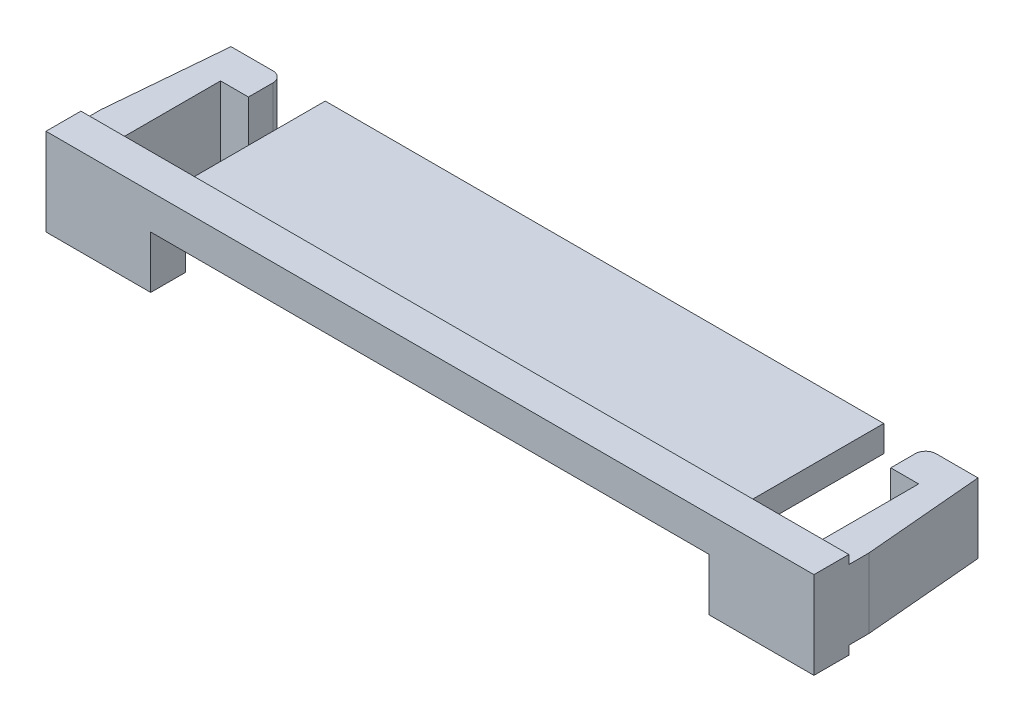
ISO-10303-21;
HEADER;
FILE_DESCRIPTION(('STEP AP214'),'2;1');
FILE_NAME('part.step','',(''),(''),'','','');
FILE_SCHEMA(('AUTOMOTIVE_DESIGN { 1 0 10303 214 1 1 1 1 }'));
ENDSEC;
DATA;
#1=APPLICATION_CONTEXT('core data for automotive mechanical design processes');
#2=APPLICATION_PROTOCOL_DEFINITION('international standard','automotive_design',2000,#1);
#3=PRODUCT_CONTEXT('',#1,'mechanical');
#4=PRODUCT('Part','Part','',(#3));
#5=PRODUCT_RELATED_PRODUCT_CATEGORY('part','',(#4));
#6=PRODUCT_DEFINITION_FORMATION('','',#4);
#7=PRODUCT_DEFINITION_CONTEXT('part definition',#1,'design');
#8=PRODUCT_DEFINITION('design','',#6,#7);
#9=PRODUCT_DEFINITION_SHAPE('','',#8);
#10=(LENGTH_UNIT() NAMED_UNIT(*) SI_UNIT(.MILLI.,.METRE.));
#11=(NAMED_UNIT(*) PLANE_ANGLE_UNIT() SI_UNIT($,.RADIAN.));
#12=(NAMED_UNIT(*) SI_UNIT($,.STERADIAN.) SOLID_ANGLE_UNIT());
#13=UNCERTAINTY_MEASURE_WITH_UNIT(LENGTH_MEASURE(1.E-05),#10,'distance_accuracy_value','');
#14=(GEOMETRIC_REPRESENTATION_CONTEXT(3) GLOBAL_UNCERTAINTY_ASSIGNED_CONTEXT((#13)) GLOBAL_UNIT_ASSIGNED_CONTEXT((#10,
#11,#12)) REPRESENTATION_CONTEXT('',''));
#15=CARTESIAN_POINT('',(0.,0.,0.));
#16=DIRECTION('',(0.,0.,1.));
#17=DIRECTION('',(1.,0.,0.));
#18=AXIS2_PLACEMENT_3D('',#15,#16,#17);
#19=CARTESIAN_POINT('',(-11.,-1.25,5.));
#20=DIRECTION('',(0.,1.,0.));
#21=DIRECTION('',(0.,0.,1.));
#22=AXIS2_PLACEMENT_3D('',#19,#20,#21);
#23=PLANE('',#22);
#24=DIRECTION('',(1.,0.,0.));
#25=VECTOR('',#24,1.);
#26=CARTESIAN_POINT('',(-11.,-1.25,5.));
#27=LINE('',#26,#25);
#28=CARTESIAN_POINT('',(8.,-1.25,5.));
#29=VERTEX_POINT('',#28);
#30=CARTESIAN_POINT('',(11.,-1.25,5.));
#31=VERTEX_POINT('',#30);
#32=EDGE_CURVE('E361',#29,#31,#27,.T.);
#33=ORIENTED_EDGE('',*,*,#32,.F.);
#34=DIRECTION('',(0.,0.,-1.));
#35=VECTOR('',#34,1.);
#36=CARTESIAN_POINT('',(8.,-1.25,5.));
#37=LINE('',#36,#35);
#38=CARTESIAN_POINT('',(8.,-1.25,4.));
#39=VERTEX_POINT('',#38);
#40=EDGE_CURVE('E265',#29,#39,#37,.T.);
#41=ORIENTED_EDGE('',*,*,#40,.T.);
#42=DIRECTION('',(-1.,0.,0.));
#43=VECTOR('',#42,1.);
#44=CARTESIAN_POINT('',(-11.,-1.25,4.));
#45=LINE('',#44,#43);
#46=CARTESIAN_POINT('',(11.,-1.25,4.));
#47=VERTEX_POINT('',#46);
#48=EDGE_CURVE('E346',#47,#39,#45,.T.);
#49=ORIENTED_EDGE('',*,*,#48,.F.);
#50=DIRECTION('',(0.,0.,-1.));
#51=VECTOR('',#50,1.);
#52=CARTESIAN_POINT('',(11.,-1.25,5.));
#53=LINE('',#52,#51);
#54=EDGE_CURVE('E365',#31,#47,#53,.T.);
#55=ORIENTED_EDGE('',*,*,#54,.F.);
#56=EDGE_LOOP('',(#33,#41,#49,#55));
#57=FACE_BOUND('',#56,.T.);
#58=ADVANCED_FACE('F34',(#57),#23,.F.);
#59=CARTESIAN_POINT('',(0.,0.,0.));
#60=DIRECTION('',(0.,0.,1.));
#61=DIRECTION('',(1.,0.,0.));
#62=AXIS2_PLACEMENT_3D('',#59,#60,#61);
#63=PLANE('',#62);
#64=DIRECTION('',(-1.,0.,0.));
#65=VECTOR('',#64,1.);
#66=CARTESIAN_POINT('',(11.,1.,0.));
#67=LINE('',#66,#65);
#68=CARTESIAN_POINT('',(10.7,1.,0.));
#69=VERTEX_POINT('',#68);
#70=CARTESIAN_POINT('',(9.5,1.,0.));
#71=VERTEX_POINT('',#70);
#72=EDGE_CURVE('E316',#69,#71,#67,.T.);
#73=ORIENTED_EDGE('',*,*,#72,.F.);
#74=DIRECTION('',(0.,-1.,0.));
#75=VECTOR('',#74,1.);
#76=CARTESIAN_POINT('',(10.7,0.,0.));
#77=LINE('',#76,#75);
#78=CARTESIAN_POINT('',(10.7,-1.,0.));
#79=VERTEX_POINT('',#78);
#80=EDGE_CURVE('E408',#69,#79,#77,.T.);
#81=ORIENTED_EDGE('',*,*,#80,.T.);
#82=DIRECTION('',(1.,0.,0.));
#83=VECTOR('',#82,1.);
#84=CARTESIAN_POINT('',(-11.,-1.,0.));
#85=LINE('',#84,#83);
#86=CARTESIAN_POINT('',(9.5,-1.,0.));
#87=VERTEX_POINT('',#86);
#88=EDGE_CURVE('E292',#87,#79,#85,.T.);
#89=ORIENTED_EDGE('',*,*,#88,.F.);
#90=DIRECTION('',(0.,1.,0.));
#91=VECTOR('',#90,1.);
#92=CARTESIAN_POINT('',(9.5,1.,0.));
#93=LINE('',#92,#91);
#94=EDGE_CURVE('E385',#87,#71,#93,.T.);
#95=ORIENTED_EDGE('',*,*,#94,.T.);
#96=EDGE_LOOP('',(#73,#81,#89,#95));
#97=FACE_BOUND('',#96,.T.);
#98=ADVANCED_FACE('F489',(#97),#63,.F.);
#99=CARTESIAN_POINT('',(-10.7,-1.,0.));
#100=VERTEX_POINT('',#99);
#101=CARTESIAN_POINT('',(-9.5,-1.,0.));
#102=VERTEX_POINT('',#101);
#103=EDGE_CURVE('E339',#100,#102,#85,.T.);
#104=ORIENTED_EDGE('',*,*,#103,.F.);
#105=DIRECTION('',(0.,1.,0.));
#106=VECTOR('',#105,1.);
#107=CARTESIAN_POINT('',(-10.7,0.,0.));
#108=LINE('',#107,#106);
#109=CARTESIAN_POINT('',(-10.7,1.,0.));
#110=VERTEX_POINT('',#109);
#111=EDGE_CURVE('E42',#100,#110,#108,.T.);
#112=ORIENTED_EDGE('',*,*,#111,.T.);
#113=CARTESIAN_POINT('',(-9.5,1.,0.));
#114=VERTEX_POINT('',#113);
#115=EDGE_CURVE('E328',#114,#110,#67,.T.);
#116=ORIENTED_EDGE('',*,*,#115,.F.);
#117=DIRECTION('',(0.,1.,0.));
#118=VECTOR('',#117,1.);
#119=CARTESIAN_POINT('',(-9.5,-1.,0.));
#120=LINE('',#119,#118);
#121=EDGE_CURVE('E398',#114,#102,#120,.F.);
#122=ORIENTED_EDGE('',*,*,#121,.T.);
#123=EDGE_LOOP('',(#104,#112,#116,#122));
#124=FACE_BOUND('',#123,.T.);
#125=ADVANCED_FACE('F494',(#124),#63,.F.);
#126=CARTESIAN_POINT('',(-11.,-1.,4.));
#127=DIRECTION('',(0.,1.,0.));
#128=DIRECTION('',(-1.,0.,0.));
#129=AXIS2_PLACEMENT_3D('',#126,#127,#128);
#130=PLANE('',#129);
#131=ORIENTED_EDGE('',*,*,#88,.T.);
#132=DIRECTION('',(-0.0871557427476589,0.,-0.996194698091746));
#133=VECTOR('',#132,1.);
#134=CARTESIAN_POINT('',(11.,-1.,3.42901569082837));
#135=LINE('',#134,#133);
#136=CARTESIAN_POINT('',(11.,-1.,3.42901569082837));
#137=VERTEX_POINT('',#136);
#138=EDGE_CURVE('E410',#79,#137,#135,.F.);
#139=ORIENTED_EDGE('',*,*,#138,.T.);
#140=DIRECTION('',(0.,0.,-1.));
#141=VECTOR('',#140,1.);
#142=CARTESIAN_POINT('',(11.,-1.,4.));
#143=LINE('',#142,#141);
#144=CARTESIAN_POINT('',(11.,-1.,4.));
#145=VERTEX_POINT('',#144);
#146=EDGE_CURVE('E351',#145,#137,#143,.T.);
#147=ORIENTED_EDGE('',*,*,#146,.F.);
#148=DIRECTION('',(1.,0.,0.));
#149=VECTOR('',#148,1.);
#150=CARTESIAN_POINT('',(-11.,-1.,4.));
#151=LINE('',#150,#149);
#152=CARTESIAN_POINT('',(10.,-1.,4.));
#153=VERTEX_POINT('',#152);
#154=EDGE_CURVE('E338',#153,#145,#151,.T.);
#155=ORIENTED_EDGE('',*,*,#154,.F.);
#156=DIRECTION('',(0.,0.,-1.));
#157=VECTOR('',#156,1.);
#158=CARTESIAN_POINT('',(10.,-1.,4.));
#159=LINE('',#158,#157);
#160=CARTESIAN_POINT('',(10.,-1.,1.));
#161=VERTEX_POINT('',#160);
#162=EDGE_CURVE('E237',#153,#161,#159,.T.);
#163=ORIENTED_EDGE('',*,*,#162,.T.);
#164=DIRECTION('',(1.,0.,0.));
#165=VECTOR('',#164,1.);
#166=CARTESIAN_POINT('',(11.,-1.,1.));
#167=LINE('',#166,#165);
#168=CARTESIAN_POINT('',(9.2,-1.,1.));
#169=VERTEX_POINT('',#168);
#170=EDGE_CURVE('E223',#169,#161,#167,.T.);
#171=ORIENTED_EDGE('',*,*,#170,.F.);
#172=DIRECTION('',(0.,0.,1.));
#173=VECTOR('',#172,1.);
#174=CARTESIAN_POINT('',(9.2,-1.,0.));
#175=LINE('',#174,#173);
#176=CARTESIAN_POINT('',(9.2,-1.,0.3));
#177=VERTEX_POINT('',#176);
#178=EDGE_CURVE('E212',#177,#169,#175,.T.);
#179=ORIENTED_EDGE('',*,*,#178,.F.);
#180=CARTESIAN_POINT('',(9.5,-1.,0.3));
#181=DIRECTION('',(0.,1.,0.));
#182=DIRECTION('',(-1.,0.,0.));
#183=AXIS2_PLACEMENT_3D('',#180,#181,#182);
#184=CIRCLE('',#183,0.3);
#185=EDGE_CURVE('E391',#177,#87,#184,.F.);
#186=ORIENTED_EDGE('',*,*,#185,.T.);
#187=EDGE_LOOP('',(#131,#139,#147,#155,#163,#171,#179,#186));
#188=FACE_BOUND('',#187,.T.);
#189=ADVANCED_FACE('F235',(#188),#130,.F.);
#190=DIRECTION('',(0.,0.,-1.));
#191=VECTOR('',#190,1.);
#192=CARTESIAN_POINT('',(-11.,-1.,4.));
#193=LINE('',#192,#191);
#194=CARTESIAN_POINT('',(-11.,-1.,4.));
#195=VERTEX_POINT('',#194);
#196=CARTESIAN_POINT('',(-11.,-1.,3.42901569082837));
#197=VERTEX_POINT('',#196);
#198=EDGE_CURVE('E349',#195,#197,#193,.T.);
#199=ORIENTED_EDGE('',*,*,#198,.T.);
#200=DIRECTION('',(-0.0871557427476589,0.,0.996194698091746));
#201=VECTOR('',#200,1.);
#202=CARTESIAN_POINT('',(-11.,-1.,3.42901569082837));
#203=LINE('',#202,#201);
#204=EDGE_CURVE('E56',#197,#100,#203,.F.);
#205=ORIENTED_EDGE('',*,*,#204,.T.);
#206=ORIENTED_EDGE('',*,*,#103,.T.);
#207=CARTESIAN_POINT('',(-9.5,-1.,0.3));
#208=DIRECTION('',(0.,1.,0.));
#209=DIRECTION('',(-1.,0.,0.));
#210=AXIS2_PLACEMENT_3D('',#207,#208,#209);
#211=CIRCLE('',#210,0.3);
#212=CARTESIAN_POINT('',(-9.2,-1.,0.3));
#213=VERTEX_POINT('',#212);
#214=EDGE_CURVE('E401',#102,#213,#211,.F.);
#215=ORIENTED_EDGE('',*,*,#214,.T.);
#216=DIRECTION('',(0.,0.,-1.));
#217=VECTOR('',#216,1.);
#218=CARTESIAN_POINT('',(-9.2,-1.,0.));
#219=LINE('',#218,#217);
#220=CARTESIAN_POINT('',(-9.2,-1.,1.));
#221=VERTEX_POINT('',#220);
#222=EDGE_CURVE('E245',#221,#213,#219,.T.);
#223=ORIENTED_EDGE('',*,*,#222,.F.);
#224=DIRECTION('',(1.,0.,0.));
#225=VECTOR('',#224,1.);
#226=CARTESIAN_POINT('',(-11.,-1.,1.));
#227=LINE('',#226,#225);
#228=CARTESIAN_POINT('',(-9.99999999999999,-1.,1.));
#229=VERTEX_POINT('',#228);
#230=EDGE_CURVE('E243',#229,#221,#227,.T.);
#231=ORIENTED_EDGE('',*,*,#230,.F.);
#232=DIRECTION('',(0.,0.,-1.));
#233=VECTOR('',#232,1.);
#234=CARTESIAN_POINT('',(-9.99999999999999,-1.,4.));
#235=LINE('',#234,#233);
#236=CARTESIAN_POINT('',(-9.99999999999999,-1.,4.));
#237=VERTEX_POINT('',#236);
#238=EDGE_CURVE('E289',#237,#229,#235,.T.);
#239=ORIENTED_EDGE('',*,*,#238,.F.);
#240=EDGE_CURVE('E340',#195,#237,#151,.T.);
#241=ORIENTED_EDGE('',*,*,#240,.F.);
#242=EDGE_LOOP('',(#199,#205,#206,#215,#223,#231,#239,#241));
#243=FACE_BOUND('',#242,.T.);
#244=ADVANCED_FACE('F424',(#243),#130,.F.);
#245=CARTESIAN_POINT('',(11.,1.,4.));
#246=DIRECTION('',(0.,-1.,0.));
#247=DIRECTION('',(0.,0.,-1.));
#248=AXIS2_PLACEMENT_3D('',#245,#246,#247);
#249=PLANE('',#248);
#250=DIRECTION('',(0.,0.,-1.));
#251=VECTOR('',#250,1.);
#252=CARTESIAN_POINT('',(11.,1.,4.));
#253=LINE('',#252,#251);
#254=CARTESIAN_POINT('',(11.,1.,4.));
#255=VERTEX_POINT('',#254);
#256=CARTESIAN_POINT('',(11.,1.,3.42901569082837));
#257=VERTEX_POINT('',#256);
#258=EDGE_CURVE('E325',#255,#257,#253,.T.);
#259=ORIENTED_EDGE('',*,*,#258,.T.);
#260=DIRECTION('',(0.0871557427476589,0.,0.996194698091746));
#261=VECTOR('',#260,1.);
#262=CARTESIAN_POINT('',(11.,1.,3.42901569082837));
#263=LINE('',#262,#261);
#264=EDGE_CURVE('E406',#257,#69,#263,.F.);
#265=ORIENTED_EDGE('',*,*,#264,.T.);
#266=ORIENTED_EDGE('',*,*,#72,.T.);
#267=CARTESIAN_POINT('',(9.5,1.,0.3));
#268=DIRECTION('',(0.,-1.,0.));
#269=DIRECTION('',(0.,0.,-1.));
#270=AXIS2_PLACEMENT_3D('',#267,#268,#269);
#271=CIRCLE('',#270,0.3);
#272=CARTESIAN_POINT('',(9.2,1.,0.3));
#273=VERTEX_POINT('',#272);
#274=EDGE_CURVE('E388',#71,#273,#271,.F.);
#275=ORIENTED_EDGE('',*,*,#274,.T.);
#276=DIRECTION('',(0.,0.,1.));
#277=VECTOR('',#276,1.);
#278=CARTESIAN_POINT('',(9.2,1.,0.));
#279=LINE('',#278,#277);
#280=CARTESIAN_POINT('',(9.2,1.,1.));
#281=VERTEX_POINT('',#280);
#282=EDGE_CURVE('E240',#273,#281,#279,.T.);
#283=ORIENTED_EDGE('',*,*,#282,.T.);
#284=DIRECTION('',(1.,0.,0.));
#285=VECTOR('',#284,1.);
#286=CARTESIAN_POINT('',(11.,1.,1.));
#287=LINE('',#286,#285);
#288=CARTESIAN_POINT('',(10.,1.,1.));
#289=VERTEX_POINT('',#288);
#290=EDGE_CURVE('E224',#281,#289,#287,.T.);
#291=ORIENTED_EDGE('',*,*,#290,.T.);
#292=DIRECTION('',(0.,0.,-1.));
#293=VECTOR('',#292,1.);
#294=CARTESIAN_POINT('',(10.,1.,4.));
#295=LINE('',#294,#293);
#296=CARTESIAN_POINT('',(10.,1.,4.));
#297=VERTEX_POINT('',#296);
#298=EDGE_CURVE('E290',#297,#289,#295,.T.);
#299=ORIENTED_EDGE('',*,*,#298,.F.);
#300=DIRECTION('',(-1.,0.,0.));
#301=VECTOR('',#300,1.);
#302=CARTESIAN_POINT('',(11.,1.,4.));
#303=LINE('',#302,#301);
#304=EDGE_CURVE('E317',#255,#297,#303,.T.);
#305=ORIENTED_EDGE('',*,*,#304,.F.);
#306=EDGE_LOOP('',(#259,#265,#266,#275,#283,#291,#299,#305));
#307=FACE_BOUND('',#306,.T.);
#308=ADVANCED_FACE('F450',(#307),#249,.F.);
#309=ORIENTED_EDGE('',*,*,#115,.T.);
#310=DIRECTION('',(0.0871557427476589,0.,-0.996194698091746));
#311=VECTOR('',#310,1.);
#312=CARTESIAN_POINT('',(-11.,1.,3.42901569082837));
#313=LINE('',#312,#311);
#314=CARTESIAN_POINT('',(-11.,1.,3.42901569082837));
#315=VERTEX_POINT('',#314);
#316=EDGE_CURVE('E11',#110,#315,#313,.F.);
#317=ORIENTED_EDGE('',*,*,#316,.T.);
#318=DIRECTION('',(0.,0.,-1.));
#319=VECTOR('',#318,1.);
#320=CARTESIAN_POINT('',(-11.,1.,4.));
#321=LINE('',#320,#319);
#322=CARTESIAN_POINT('',(-11.,1.,4.));
#323=VERTEX_POINT('',#322);
#324=EDGE_CURVE('E329',#323,#315,#321,.T.);
#325=ORIENTED_EDGE('',*,*,#324,.F.);
#326=CARTESIAN_POINT('',(-9.99999999999999,1.,4.));
#327=VERTEX_POINT('',#326);
#328=EDGE_CURVE('E315',#327,#323,#303,.T.);
#329=ORIENTED_EDGE('',*,*,#328,.F.);
#330=DIRECTION('',(0.,0.,-1.));
#331=VECTOR('',#330,1.);
#332=CARTESIAN_POINT('',(-9.99999999999999,1.,4.));
#333=LINE('',#332,#331);
#334=CARTESIAN_POINT('',(-9.99999999999999,1.,1.));
#335=VERTEX_POINT('',#334);
#336=EDGE_CURVE('E303',#327,#335,#333,.T.);
#337=ORIENTED_EDGE('',*,*,#336,.T.);
#338=DIRECTION('',(1.,0.,0.));
#339=VECTOR('',#338,1.);
#340=CARTESIAN_POINT('',(-11.,1.,1.));
#341=LINE('',#340,#339);
#342=CARTESIAN_POINT('',(-9.2,1.,1.));
#343=VERTEX_POINT('',#342);
#344=EDGE_CURVE('E231',#335,#343,#341,.T.);
#345=ORIENTED_EDGE('',*,*,#344,.T.);
#346=DIRECTION('',(0.,0.,-1.));
#347=VECTOR('',#346,1.);
#348=CARTESIAN_POINT('',(-9.2,1.,0.));
#349=LINE('',#348,#347);
#350=CARTESIAN_POINT('',(-9.2,1.,0.3));
#351=VERTEX_POINT('',#350);
#352=EDGE_CURVE('E246',#343,#351,#349,.T.);
#353=ORIENTED_EDGE('',*,*,#352,.T.);
#354=CARTESIAN_POINT('',(-9.5,1.,0.3));
#355=DIRECTION('',(0.,-1.,0.));
#356=DIRECTION('',(0.,0.,-1.));
#357=AXIS2_PLACEMENT_3D('',#354,#355,#356);
#358=CIRCLE('',#357,0.3);
#359=EDGE_CURVE('E396',#351,#114,#358,.F.);
#360=ORIENTED_EDGE('',*,*,#359,.T.);
#361=EDGE_LOOP('',(#309,#317,#325,#329,#337,#345,#353,#360));
#362=FACE_BOUND('',#361,.T.);
#363=ADVANCED_FACE('F480',(#362),#249,.F.);
#364=CARTESIAN_POINT('',(-11.,1.25,5.));
#365=DIRECTION('',(0.,-1.,0.));
#366=DIRECTION('',(0.,0.,-1.));
#367=AXIS2_PLACEMENT_3D('',#364,#365,#366);
#368=PLANE('',#367);
#369=DIRECTION('',(1.,0.,0.));
#370=VECTOR('',#369,1.);
#371=CARTESIAN_POINT('',(11.,1.25,4.));
#372=LINE('',#371,#370);
#373=CARTESIAN_POINT('',(-11.,1.25,4.));
#374=VERTEX_POINT('',#373);
#375=CARTESIAN_POINT('',(11.,1.25,4.));
#376=VERTEX_POINT('',#375);
#377=EDGE_CURVE('E323',#374,#376,#372,.T.);
#378=ORIENTED_EDGE('',*,*,#377,.F.);
#379=DIRECTION('',(0.,0.,-1.));
#380=VECTOR('',#379,1.);
#381=CARTESIAN_POINT('',(-11.,1.25,5.));
#382=LINE('',#381,#380);
#383=CARTESIAN_POINT('',(-11.,1.25,5.));
#384=VERTEX_POINT('',#383);
#385=EDGE_CURVE('E371',#384,#374,#382,.T.);
#386=ORIENTED_EDGE('',*,*,#385,.F.);
#387=DIRECTION('',(-1.,0.,0.));
#388=VECTOR('',#387,1.);
#389=CARTESIAN_POINT('',(-11.,1.25,5.));
#390=LINE('',#389,#388);
#391=CARTESIAN_POINT('',(11.,1.25,5.));
#392=VERTEX_POINT('',#391);
#393=EDGE_CURVE('E357',#392,#384,#390,.T.);
#394=ORIENTED_EDGE('',*,*,#393,.F.);
#395=DIRECTION('',(0.,0.,-1.));
#396=VECTOR('',#395,1.);
#397=CARTESIAN_POINT('',(11.,1.25,5.));
#398=LINE('',#397,#396);
#399=EDGE_CURVE('E374',#392,#376,#398,.T.);
#400=ORIENTED_EDGE('',*,*,#399,.T.);
#401=EDGE_LOOP('',(#378,#386,#394,#400));
#402=FACE_BOUND('',#401,.T.);
#403=ADVANCED_FACE('F441',(#402),#368,.F.);
#404=CARTESIAN_POINT('',(-7.99999999999999,-1.25,4.));
#405=VERTEX_POINT('',#404);
#406=CARTESIAN_POINT('',(-11.,-1.25,4.));
#407=VERTEX_POINT('',#406);
#408=EDGE_CURVE('E345',#405,#407,#45,.T.);
#409=ORIENTED_EDGE('',*,*,#408,.F.);
#410=DIRECTION('',(0.,0.,-1.));
#411=VECTOR('',#410,1.);
#412=CARTESIAN_POINT('',(-7.99999999999999,-1.25,5.));
#413=LINE('',#412,#411);
#414=CARTESIAN_POINT('',(-7.99999999999999,-1.25,5.));
#415=VERTEX_POINT('',#414);
#416=EDGE_CURVE('E275',#415,#405,#413,.T.);
#417=ORIENTED_EDGE('',*,*,#416,.F.);
#418=CARTESIAN_POINT('',(-11.,-1.25,5.));
#419=VERTEX_POINT('',#418);
#420=EDGE_CURVE('E362',#419,#415,#27,.T.);
#421=ORIENTED_EDGE('',*,*,#420,.F.);
#422=DIRECTION('',(0.,0.,-1.));
#423=VECTOR('',#422,1.);
#424=CARTESIAN_POINT('',(-11.,-1.25,5.));
#425=LINE('',#424,#423);
#426=EDGE_CURVE('E368',#419,#407,#425,.T.);
#427=ORIENTED_EDGE('',*,*,#426,.T.);
#428=EDGE_LOOP('',(#409,#417,#421,#427));
#429=FACE_BOUND('',#428,.T.);
#430=ADVANCED_FACE('F434',(#429),#23,.F.);
#431=CARTESIAN_POINT('',(11.,1.25,5.));
#432=DIRECTION('',(-1.,0.,0.));
#433=DIRECTION('',(0.,0.,1.));
#434=AXIS2_PLACEMENT_3D('',#431,#432,#433);
#435=PLANE('',#434);
#436=ORIENTED_EDGE('',*,*,#146,.T.);
#437=DIRECTION('',(0.,1.,0.));
#438=VECTOR('',#437,1.);
#439=CARTESIAN_POINT('',(11.,1.25,3.42901569082837));
#440=LINE('',#439,#438);
#441=EDGE_CURVE('E403',#137,#257,#440,.T.);
#442=ORIENTED_EDGE('',*,*,#441,.T.);
#443=ORIENTED_EDGE('',*,*,#258,.F.);
#444=DIRECTION('',(0.,-1.,0.));
#445=VECTOR('',#444,1.);
#446=CARTESIAN_POINT('',(11.,1.25,4.));
#447=LINE('',#446,#445);
#448=EDGE_CURVE('E312',#376,#255,#447,.T.);
#449=ORIENTED_EDGE('',*,*,#448,.F.);
#450=ORIENTED_EDGE('',*,*,#399,.F.);
#451=DIRECTION('',(0.,1.,0.));
#452=VECTOR('',#451,1.);
#453=CARTESIAN_POINT('',(11.,1.25,5.));
#454=LINE('',#453,#452);
#455=EDGE_CURVE('E332',#31,#392,#454,.T.);
#456=ORIENTED_EDGE('',*,*,#455,.F.);
#457=ORIENTED_EDGE('',*,*,#54,.T.);
#458=DIRECTION('',(0.,-1.,0.));
#459=VECTOR('',#458,1.);
#460=CARTESIAN_POINT('',(11.,-1.25,4.));
#461=LINE('',#460,#459);
#462=EDGE_CURVE('E343',#145,#47,#461,.T.);
#463=ORIENTED_EDGE('',*,*,#462,.F.);
#464=EDGE_LOOP('',(#436,#442,#443,#449,#450,#456,#457,#463));
#465=FACE_BOUND('',#464,.T.);
#466=ADVANCED_FACE('F446',(#465),#435,.F.);
#467=CARTESIAN_POINT('',(-11.,1.25,5.));
#468=DIRECTION('',(1.,0.,0.));
#469=DIRECTION('',(0.,0.,-1.));
#470=AXIS2_PLACEMENT_3D('',#467,#468,#469);
#471=PLANE('',#470);
#472=ORIENTED_EDGE('',*,*,#324,.T.);
#473=DIRECTION('',(0.,-1.,0.));
#474=VECTOR('',#473,1.);
#475=CARTESIAN_POINT('',(-11.,1.25,3.42901569082837));
#476=LINE('',#475,#474);
#477=EDGE_CURVE('E412',#315,#197,#476,.T.);
#478=ORIENTED_EDGE('',*,*,#477,.T.);
#479=ORIENTED_EDGE('',*,*,#198,.F.);
#480=DIRECTION('',(0.,1.,0.));
#481=VECTOR('',#480,1.);
#482=CARTESIAN_POINT('',(-11.,-1.25,4.));
#483=LINE('',#482,#481);
#484=EDGE_CURVE('E335',#407,#195,#483,.T.);
#485=ORIENTED_EDGE('',*,*,#484,.F.);
#486=ORIENTED_EDGE('',*,*,#426,.F.);
#487=DIRECTION('',(0.,-1.,0.));
#488=VECTOR('',#487,1.);
#489=CARTESIAN_POINT('',(-11.,1.25,5.));
#490=LINE('',#489,#488);
#491=EDGE_CURVE('E359',#384,#419,#490,.T.);
#492=ORIENTED_EDGE('',*,*,#491,.F.);
#493=ORIENTED_EDGE('',*,*,#385,.T.);
#494=DIRECTION('',(0.,1.,0.));
#495=VECTOR('',#494,1.);
#496=CARTESIAN_POINT('',(-11.,1.25,4.));
#497=LINE('',#496,#495);
#498=EDGE_CURVE('E320',#323,#374,#497,.T.);
#499=ORIENTED_EDGE('',*,*,#498,.F.);
#500=EDGE_LOOP('',(#472,#478,#479,#485,#486,#492,#493,#499));
#501=FACE_BOUND('',#500,.T.);
#502=ADVANCED_FACE('F418',(#501),#471,.F.);
#503=CARTESIAN_POINT('',(0.,0.,5.));
#504=DIRECTION('',(0.,0.,1.));
#505=DIRECTION('',(1.,0.,0.));
#506=AXIS2_PLACEMENT_3D('',#503,#504,#505);
#507=PLANE('',#506);
#508=DIRECTION('',(0.,-1.,0.));
#509=VECTOR('',#508,1.);
#510=CARTESIAN_POINT('',(8.,0.25,5.));
#511=LINE('',#510,#509);
#512=CARTESIAN_POINT('',(8.,0.25,5.));
#513=VERTEX_POINT('',#512);
#514=EDGE_CURVE('E256',#513,#29,#511,.T.);
#515=ORIENTED_EDGE('',*,*,#514,.T.);
#516=ORIENTED_EDGE('',*,*,#32,.T.);
#517=ORIENTED_EDGE('',*,*,#455,.T.);
#518=ORIENTED_EDGE('',*,*,#393,.T.);
#519=ORIENTED_EDGE('',*,*,#491,.T.);
#520=ORIENTED_EDGE('',*,*,#420,.T.);
#521=DIRECTION('',(0.,1.,0.));
#522=VECTOR('',#521,1.);
#523=CARTESIAN_POINT('',(-7.99999999999999,0.25,5.));
#524=LINE('',#523,#522);
#525=CARTESIAN_POINT('',(-7.99999999999999,0.25,5.));
#526=VERTEX_POINT('',#525);
#527=EDGE_CURVE('E259',#415,#526,#524,.T.);
#528=ORIENTED_EDGE('',*,*,#527,.T.);
#529=DIRECTION('',(1.,0.,0.));
#530=VECTOR('',#529,1.);
#531=CARTESIAN_POINT('',(8.,0.25,5.));
#532=LINE('',#531,#530);
#533=EDGE_CURVE('E262',#526,#513,#532,.T.);
#534=ORIENTED_EDGE('',*,*,#533,.T.);
#535=EDGE_LOOP('',(#515,#516,#517,#518,#519,#520,#528,#534));
#536=FACE_BOUND('',#535,.T.);
#537=ADVANCED_FACE('F437',(#536),#507,.T.);
#538=DIRECTION('',(0.,1.,0.));
#539=VECTOR('',#538,1.);
#540=CARTESIAN_POINT('',(8.,1.,0.));
#541=LINE('',#540,#539);
#542=CARTESIAN_POINT('',(8.,0.25,0.));
#543=VERTEX_POINT('',#542);
#544=CARTESIAN_POINT('',(8.,1.,0.));
#545=VERTEX_POINT('',#544);
#546=EDGE_CURVE('E284',#543,#545,#541,.T.);
#547=ORIENTED_EDGE('',*,*,#546,.F.);
#548=DIRECTION('',(1.,0.,0.));
#549=VECTOR('',#548,1.);
#550=CARTESIAN_POINT('',(8.,0.25,0.));
#551=LINE('',#550,#549);
#552=CARTESIAN_POINT('',(-7.99999999999999,0.25,0.));
#553=VERTEX_POINT('',#552);
#554=EDGE_CURVE('E255',#553,#543,#551,.T.);
#555=ORIENTED_EDGE('',*,*,#554,.F.);
#556=DIRECTION('',(0.,-1.,0.));
#557=VECTOR('',#556,1.);
#558=CARTESIAN_POINT('',(-7.99999999999999,1.,0.));
#559=LINE('',#558,#557);
#560=CARTESIAN_POINT('',(-7.99999999999999,1.,0.));
#561=VERTEX_POINT('',#560);
#562=EDGE_CURVE('E270',#561,#553,#559,.T.);
#563=ORIENTED_EDGE('',*,*,#562,.F.);
#564=EDGE_CURVE('E327',#545,#561,#67,.T.);
#565=ORIENTED_EDGE('',*,*,#564,.F.);
#566=EDGE_LOOP('',(#547,#555,#563,#565));
#567=FACE_BOUND('',#566,.T.);
#568=ADVANCED_FACE('F497',(#567),#63,.F.);
#569=CARTESIAN_POINT('',(8.,1.,4.));
#570=VERTEX_POINT('',#569);
#571=CARTESIAN_POINT('',(-7.99999999999999,1.,4.));
#572=VERTEX_POINT('',#571);
#573=EDGE_CURVE('E321',#570,#572,#303,.T.);
#574=ORIENTED_EDGE('',*,*,#573,.F.);
#575=DIRECTION('',(0.,0.,-1.));
#576=VECTOR('',#575,1.);
#577=CARTESIAN_POINT('',(8.,1.,4.));
#578=LINE('',#577,#576);
#579=EDGE_CURVE('E293',#570,#545,#578,.T.);
#580=ORIENTED_EDGE('',*,*,#579,.T.);
#581=ORIENTED_EDGE('',*,*,#564,.T.);
#582=DIRECTION('',(0.,0.,-1.));
#583=VECTOR('',#582,1.);
#584=CARTESIAN_POINT('',(-7.99999999999999,1.,4.));
#585=LINE('',#584,#583);
#586=EDGE_CURVE('E308',#572,#561,#585,.T.);
#587=ORIENTED_EDGE('',*,*,#586,.F.);
#588=EDGE_LOOP('',(#574,#580,#581,#587));
#589=FACE_BOUND('',#588,.T.);
#590=ADVANCED_FACE('F510',(#589),#249,.F.);
#591=CARTESIAN_POINT('',(0.,0.,4.));
#592=DIRECTION('',(0.,0.,-1.));
#593=DIRECTION('',(-1.,0.,0.));
#594=AXIS2_PLACEMENT_3D('',#591,#592,#593);
#595=PLANE('',#594);
#596=ORIENTED_EDGE('',*,*,#48,.T.);
#597=DIRECTION('',(0.,1.,0.));
#598=VECTOR('',#597,1.);
#599=CARTESIAN_POINT('',(8.,1.,4.));
#600=LINE('',#599,#598);
#601=CARTESIAN_POINT('',(8.,0.25,4.));
#602=VERTEX_POINT('',#601);
#603=EDGE_CURVE('E285',#39,#602,#600,.T.);
#604=ORIENTED_EDGE('',*,*,#603,.T.);
#605=EDGE_CURVE('E283',#602,#570,#600,.T.);
#606=ORIENTED_EDGE('',*,*,#605,.T.);
#607=ORIENTED_EDGE('',*,*,#573,.T.);
#608=DIRECTION('',(0.,-1.,0.));
#609=VECTOR('',#608,1.);
#610=CARTESIAN_POINT('',(-7.99999999999999,1.,4.));
#611=LINE('',#610,#609);
#612=CARTESIAN_POINT('',(-7.99999999999999,0.25,4.));
#613=VERTEX_POINT('',#612);
#614=EDGE_CURVE('E300',#572,#613,#611,.T.);
#615=ORIENTED_EDGE('',*,*,#614,.T.);
#616=EDGE_CURVE('E299',#613,#405,#611,.T.);
#617=ORIENTED_EDGE('',*,*,#616,.T.);
#618=ORIENTED_EDGE('',*,*,#408,.T.);
#619=ORIENTED_EDGE('',*,*,#484,.T.);
#620=ORIENTED_EDGE('',*,*,#240,.T.);
#621=DIRECTION('',(0.,1.,0.));
#622=VECTOR('',#621,1.);
#623=CARTESIAN_POINT('',(-9.99999999999999,1.,4.));
#624=LINE('',#623,#622);
#625=EDGE_CURVE('E297',#237,#327,#624,.T.);
#626=ORIENTED_EDGE('',*,*,#625,.T.);
#627=ORIENTED_EDGE('',*,*,#328,.T.);
#628=ORIENTED_EDGE('',*,*,#498,.T.);
#629=ORIENTED_EDGE('',*,*,#377,.T.);
#630=ORIENTED_EDGE('',*,*,#448,.T.);
#631=ORIENTED_EDGE('',*,*,#304,.T.);
#632=DIRECTION('',(0.,-1.,0.));
#633=VECTOR('',#632,1.);
#634=CARTESIAN_POINT('',(10.,1.,4.));
#635=LINE('',#634,#633);
#636=EDGE_CURVE('E280',#297,#153,#635,.T.);
#637=ORIENTED_EDGE('',*,*,#636,.T.);
#638=ORIENTED_EDGE('',*,*,#154,.T.);
#639=ORIENTED_EDGE('',*,*,#462,.T.);
#640=EDGE_LOOP('',(#596,#604,#606,#607,#615,#617,#618,#619,#620,#626,#627,#628,#629,#630,#631,
#637,#638,#639));
#641=FACE_BOUND('',#640,.T.);
#642=ADVANCED_FACE('F428',(#641),#595,.T.);
#643=CARTESIAN_POINT('',(-9.99999999999999,1.,4.));
#644=DIRECTION('',(-1.,0.,0.));
#645=DIRECTION('',(0.,0.,1.));
#646=AXIS2_PLACEMENT_3D('',#643,#644,#645);
#647=PLANE('',#646);
#648=ORIENTED_EDGE('',*,*,#238,.T.);
#649=DIRECTION('',(0.,1.,0.));
#650=VECTOR('',#649,1.);
#651=CARTESIAN_POINT('',(-9.99999999999999,1.,1.));
#652=LINE('',#651,#650);
#653=EDGE_CURVE('E380',#229,#335,#652,.T.);
#654=ORIENTED_EDGE('',*,*,#653,.T.);
#655=ORIENTED_EDGE('',*,*,#336,.F.);
#656=ORIENTED_EDGE('',*,*,#625,.F.);
#657=EDGE_LOOP('',(#648,#654,#655,#656));
#658=FACE_BOUND('',#657,.T.);
#659=ADVANCED_FACE('F531',(#658),#647,.F.);
#660=CARTESIAN_POINT('',(-7.99999999999999,1.,4.));
#661=DIRECTION('',(1.,0.,0.));
#662=DIRECTION('',(0.,0.,-1.));
#663=AXIS2_PLACEMENT_3D('',#660,#661,#662);
#664=PLANE('',#663);
#665=ORIENTED_EDGE('',*,*,#562,.T.);
#666=DIRECTION('',(0.,0.,-1.));
#667=VECTOR('',#666,1.);
#668=CARTESIAN_POINT('',(-7.99999999999999,0.25,5.));
#669=LINE('',#668,#667);
#670=EDGE_CURVE('E274',#613,#553,#669,.T.);
#671=ORIENTED_EDGE('',*,*,#670,.F.);
#672=ORIENTED_EDGE('',*,*,#614,.F.);
#673=ORIENTED_EDGE('',*,*,#586,.T.);
#674=EDGE_LOOP('',(#665,#671,#672,#673));
#675=FACE_BOUND('',#674,.T.);
#676=ADVANCED_FACE('F538',(#675),#664,.F.);
#677=CARTESIAN_POINT('',(10.,1.,4.));
#678=DIRECTION('',(1.,0.,0.));
#679=DIRECTION('',(0.,0.,-1.));
#680=AXIS2_PLACEMENT_3D('',#677,#678,#679);
#681=PLANE('',#680);
#682=ORIENTED_EDGE('',*,*,#298,.T.);
#683=DIRECTION('',(0.,-1.,0.));
#684=VECTOR('',#683,1.);
#685=CARTESIAN_POINT('',(10.,1.,1.));
#686=LINE('',#685,#684);
#687=EDGE_CURVE('E383',#289,#161,#686,.T.);
#688=ORIENTED_EDGE('',*,*,#687,.T.);
#689=ORIENTED_EDGE('',*,*,#162,.F.);
#690=ORIENTED_EDGE('',*,*,#636,.F.);
#691=EDGE_LOOP('',(#682,#688,#689,#690));
#692=FACE_BOUND('',#691,.T.);
#693=ADVANCED_FACE('F540',(#692),#681,.F.);
#694=CARTESIAN_POINT('',(8.,1.,4.));
#695=DIRECTION('',(-1.,0.,0.));
#696=DIRECTION('',(0.,-1.,0.));
#697=AXIS2_PLACEMENT_3D('',#694,#695,#696);
#698=PLANE('',#697);
#699=ORIENTED_EDGE('',*,*,#605,.F.);
#700=DIRECTION('',(0.,0.,-1.));
#701=VECTOR('',#700,1.);
#702=CARTESIAN_POINT('',(8.,0.25,4.));
#703=LINE('',#702,#701);
#704=EDGE_CURVE('E377',#602,#543,#703,.T.);
#705=ORIENTED_EDGE('',*,*,#704,.T.);
#706=ORIENTED_EDGE('',*,*,#546,.T.);
#707=ORIENTED_EDGE('',*,*,#579,.F.);
#708=EDGE_LOOP('',(#699,#705,#706,#707));
#709=FACE_BOUND('',#708,.T.);
#710=ADVANCED_FACE('F471',(#709),#698,.F.);
#711=CARTESIAN_POINT('',(8.,0.25,5.));
#712=DIRECTION('',(1.,0.,0.));
#713=DIRECTION('',(0.,0.,-1.));
#714=AXIS2_PLACEMENT_3D('',#711,#712,#713);
#715=PLANE('',#714);
#716=ORIENTED_EDGE('',*,*,#603,.F.);
#717=ORIENTED_EDGE('',*,*,#40,.F.);
#718=ORIENTED_EDGE('',*,*,#514,.F.);
#719=DIRECTION('',(0.,0.,-1.));
#720=VECTOR('',#719,1.);
#721=CARTESIAN_POINT('',(8.,0.25,5.));
#722=LINE('',#721,#720);
#723=EDGE_CURVE('E267',#513,#602,#722,.T.);
#724=ORIENTED_EDGE('',*,*,#723,.T.);
#725=EDGE_LOOP('',(#716,#717,#718,#724));
#726=FACE_BOUND('',#725,.T.);
#727=ADVANCED_FACE('F463',(#726),#715,.F.);
#728=CARTESIAN_POINT('',(8.,0.25,5.));
#729=DIRECTION('',(0.,1.,0.));
#730=DIRECTION('',(0.,0.,1.));
#731=AXIS2_PLACEMENT_3D('',#728,#729,#730);
#732=PLANE('',#731);
#733=ORIENTED_EDGE('',*,*,#554,.T.);
#734=ORIENTED_EDGE('',*,*,#704,.F.);
#735=ORIENTED_EDGE('',*,*,#723,.F.);
#736=ORIENTED_EDGE('',*,*,#533,.F.);
#737=EDGE_CURVE('E271',#526,#613,#669,.T.);
#738=ORIENTED_EDGE('',*,*,#737,.T.);
#739=ORIENTED_EDGE('',*,*,#670,.T.);
#740=EDGE_LOOP('',(#733,#734,#735,#736,#738,#739));
#741=FACE_BOUND('',#740,.T.);
#742=ADVANCED_FACE('F466',(#741),#732,.F.);
#743=CARTESIAN_POINT('',(-7.99999999999999,0.25,5.));
#744=DIRECTION('',(-1.,0.,0.));
#745=DIRECTION('',(0.,-1.,0.));
#746=AXIS2_PLACEMENT_3D('',#743,#744,#745);
#747=PLANE('',#746);
#748=ORIENTED_EDGE('',*,*,#416,.T.);
#749=ORIENTED_EDGE('',*,*,#616,.F.);
#750=ORIENTED_EDGE('',*,*,#737,.F.);
#751=ORIENTED_EDGE('',*,*,#527,.F.);
#752=EDGE_LOOP('',(#748,#749,#750,#751));
#753=FACE_BOUND('',#752,.T.);
#754=ADVANCED_FACE('F646',(#753),#747,.F.);
#755=CARTESIAN_POINT('',(-11.,-1.,1.));
#756=DIRECTION('',(0.,0.,1.));
#757=DIRECTION('',(1.,0.,0.));
#758=AXIS2_PLACEMENT_3D('',#755,#756,#757);
#759=PLANE('',#758);
#760=ORIENTED_EDGE('',*,*,#653,.F.);
#761=ORIENTED_EDGE('',*,*,#230,.T.);
#762=DIRECTION('',(0.,1.,0.));
#763=VECTOR('',#762,1.);
#764=CARTESIAN_POINT('',(-9.2,-1.,1.));
#765=LINE('',#764,#763);
#766=EDGE_CURVE('E249',#221,#343,#765,.T.);
#767=ORIENTED_EDGE('',*,*,#766,.T.);
#768=ORIENTED_EDGE('',*,*,#344,.F.);
#769=EDGE_LOOP('',(#760,#761,#767,#768));
#770=FACE_BOUND('',#769,.T.);
#771=ADVANCED_FACE('F529',(#770),#759,.T.);
#772=CARTESIAN_POINT('',(-9.2,-1.,0.));
#773=DIRECTION('',(1.,0.,0.));
#774=DIRECTION('',(0.,0.,-1.));
#775=AXIS2_PLACEMENT_3D('',#772,#773,#774);
#776=PLANE('',#775);
#777=ORIENTED_EDGE('',*,*,#222,.T.);
#778=DIRECTION('',(0.,1.,0.));
#779=VECTOR('',#778,1.);
#780=CARTESIAN_POINT('',(-9.2,1.,0.3));
#781=LINE('',#780,#779);
#782=EDGE_CURVE('E393',#213,#351,#781,.T.);
#783=ORIENTED_EDGE('',*,*,#782,.T.);
#784=ORIENTED_EDGE('',*,*,#352,.F.);
#785=ORIENTED_EDGE('',*,*,#766,.F.);
#786=EDGE_LOOP('',(#777,#783,#784,#785));
#787=FACE_BOUND('',#786,.T.);
#788=ADVANCED_FACE('F526',(#787),#776,.T.);
#789=CARTESIAN_POINT('',(11.,-1.,1.));
#790=DIRECTION('',(0.,0.,1.));
#791=DIRECTION('',(1.,0.,0.));
#792=AXIS2_PLACEMENT_3D('',#789,#790,#791);
#793=PLANE('',#792);
#794=ORIENTED_EDGE('',*,*,#687,.F.);
#795=ORIENTED_EDGE('',*,*,#290,.F.);
#796=DIRECTION('',(0.,1.,0.));
#797=VECTOR('',#796,1.);
#798=CARTESIAN_POINT('',(9.2,-1.,1.));
#799=LINE('',#798,#797);
#800=EDGE_CURVE('E216',#169,#281,#799,.T.);
#801=ORIENTED_EDGE('',*,*,#800,.F.);
#802=ORIENTED_EDGE('',*,*,#170,.T.);
#803=EDGE_LOOP('',(#794,#795,#801,#802));
#804=FACE_BOUND('',#803,.T.);
#805=ADVANCED_FACE('F229',(#804),#793,.T.);
#806=CARTESIAN_POINT('',(9.2,-1.,0.));
#807=DIRECTION('',(-1.,0.,0.));
#808=DIRECTION('',(0.,0.,1.));
#809=AXIS2_PLACEMENT_3D('',#806,#807,#808);
#810=PLANE('',#809);
#811=ORIENTED_EDGE('',*,*,#282,.F.);
#812=DIRECTION('',(0.,1.,0.));
#813=VECTOR('',#812,1.);
#814=CARTESIAN_POINT('',(9.2,-1.,0.3));
#815=LINE('',#814,#813);
#816=EDGE_CURVE('E219',#273,#177,#815,.F.);
#817=ORIENTED_EDGE('',*,*,#816,.T.);
#818=ORIENTED_EDGE('',*,*,#178,.T.);
#819=ORIENTED_EDGE('',*,*,#800,.T.);
#820=EDGE_LOOP('',(#811,#817,#818,#819));
#821=FACE_BOUND('',#820,.T.);
#822=ADVANCED_FACE('F215',(#821),#810,.T.);
#823=CARTESIAN_POINT('',(9.5,0.,0.3));
#824=DIRECTION('',(0.,-1.,0.));
#825=DIRECTION('',(0.,0.,-1.));
#826=AXIS2_PLACEMENT_3D('',#823,#824,#825);
#827=CYLINDRICAL_SURFACE('',#826,0.3);
#828=ORIENTED_EDGE('',*,*,#185,.F.);
#829=ORIENTED_EDGE('',*,*,#816,.F.);
#830=ORIENTED_EDGE('',*,*,#274,.F.);
#831=ORIENTED_EDGE('',*,*,#94,.F.);
#832=EDGE_LOOP('',(#828,#829,#830,#831));
#833=FACE_BOUND('',#832,.T.);
#834=ADVANCED_FACE('F512',(#833),#827,.T.);
#835=CARTESIAN_POINT('',(-9.5,-1.,0.3));
#836=DIRECTION('',(0.,-1.,0.));
#837=DIRECTION('',(0.,0.,-1.));
#838=AXIS2_PLACEMENT_3D('',#835,#836,#837);
#839=CYLINDRICAL_SURFACE('',#838,0.3);
#840=ORIENTED_EDGE('',*,*,#214,.F.);
#841=ORIENTED_EDGE('',*,*,#121,.F.);
#842=ORIENTED_EDGE('',*,*,#359,.F.);
#843=ORIENTED_EDGE('',*,*,#782,.F.);
#844=EDGE_LOOP('',(#840,#841,#842,#843));
#845=FACE_BOUND('',#844,.T.);
#846=ADVANCED_FACE('F486',(#845),#839,.T.);
#847=CARTESIAN_POINT('',(11.,1.25,3.42901569082837));
#848=DIRECTION('',(-0.996194698091746,0.,0.0871557427476589));
#849=DIRECTION('',(0.,1.,0.));
#850=AXIS2_PLACEMENT_3D('',#847,#848,#849);
#851=PLANE('',#850);
#852=ORIENTED_EDGE('',*,*,#138,.F.);
#853=ORIENTED_EDGE('',*,*,#80,.F.);
#854=ORIENTED_EDGE('',*,*,#264,.F.);
#855=ORIENTED_EDGE('',*,*,#441,.F.);
#856=EDGE_LOOP('',(#852,#853,#854,#855));
#857=FACE_BOUND('',#856,.T.);
#858=ADVANCED_FACE('F482',(#857),#851,.F.);
#859=CARTESIAN_POINT('',(-11.,1.25,3.42901569082837));
#860=DIRECTION('',(0.996194698091746,0.,0.0871557427476589));
#861=DIRECTION('',(0.,-1.,0.));
#862=AXIS2_PLACEMENT_3D('',#859,#860,#861);
#863=PLANE('',#862);
#864=ORIENTED_EDGE('',*,*,#316,.F.);
#865=ORIENTED_EDGE('',*,*,#111,.F.);
#866=ORIENTED_EDGE('',*,*,#204,.F.);
#867=ORIENTED_EDGE('',*,*,#477,.F.);
#868=EDGE_LOOP('',(#864,#865,#866,#867));
#869=FACE_BOUND('',#868,.T.);
#870=ADVANCED_FACE('F36',(#869),#863,.F.);
#871=CLOSED_SHELL('',(#58,#98,#125,#189,#244,#308,#363,#403,#430,#466,#502,#537,#568,#590,#642,
#659,#676,#693,#710,#727,#742,#754,#771,#788,#805,#822,#834,#846,#858,#870));
#872=MANIFOLD_SOLID_BREP('B2',#871);
#873=ADVANCED_BREP_SHAPE_REPRESENTATION('',(#18,#872),#14);
#874=SHAPE_DEFINITION_REPRESENTATION(#9,#873);
ENDSEC;
END-ISO-10303-21;
